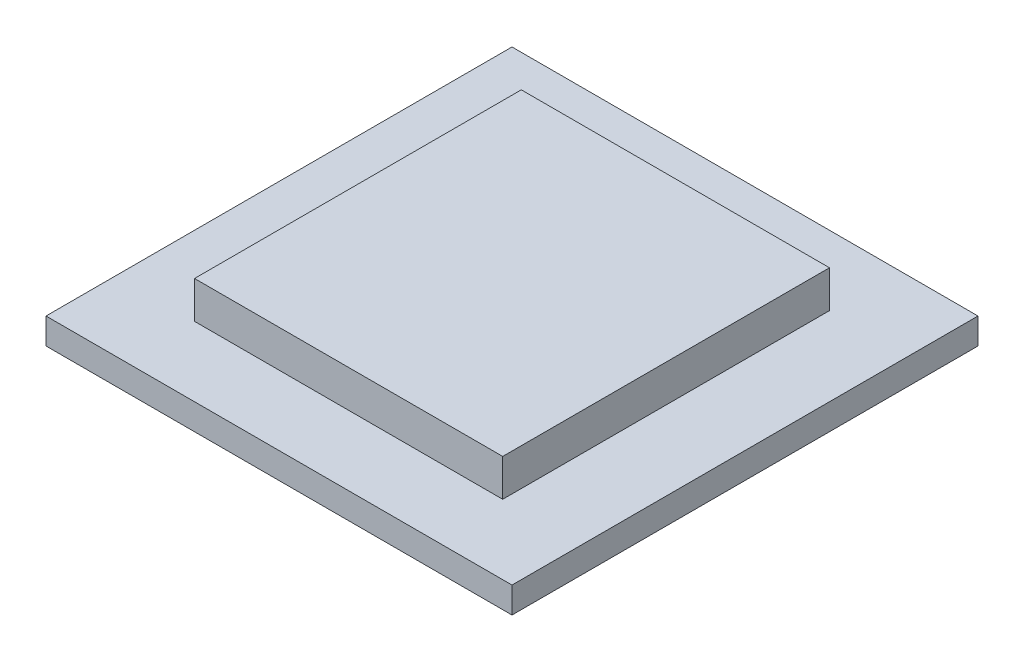
ISO-10303-21;
HEADER;
FILE_DESCRIPTION(('STEP AP214'),'2;1');
FILE_NAME('part.step','',(''),(''),'','','');
FILE_SCHEMA(('AUTOMOTIVE_DESIGN { 1 0 10303 214 1 1 1 1 }'));
ENDSEC;
DATA;
#1=APPLICATION_CONTEXT('core data for automotive mechanical design processes');
#2=APPLICATION_PROTOCOL_DEFINITION('international standard','automotive_design',2000,#1);
#3=PRODUCT_CONTEXT('',#1,'mechanical');
#4=PRODUCT('Part','Part','',(#3));
#5=PRODUCT_RELATED_PRODUCT_CATEGORY('part','',(#4));
#6=PRODUCT_DEFINITION_FORMATION('','',#4);
#7=PRODUCT_DEFINITION_CONTEXT('part definition',#1,'design');
#8=PRODUCT_DEFINITION('design','',#6,#7);
#9=PRODUCT_DEFINITION_SHAPE('','',#8);
#10=(LENGTH_UNIT() NAMED_UNIT(*) SI_UNIT(.MILLI.,.METRE.));
#11=(NAMED_UNIT(*) PLANE_ANGLE_UNIT() SI_UNIT($,.RADIAN.));
#12=(NAMED_UNIT(*) SI_UNIT($,.STERADIAN.) SOLID_ANGLE_UNIT());
#13=UNCERTAINTY_MEASURE_WITH_UNIT(LENGTH_MEASURE(1.E-05),#10,'distance_accuracy_value','');
#14=(GEOMETRIC_REPRESENTATION_CONTEXT(3) GLOBAL_UNCERTAINTY_ASSIGNED_CONTEXT((#13)) GLOBAL_UNIT_ASSIGNED_CONTEXT((#10,
#11,#12)) REPRESENTATION_CONTEXT('',''));
#15=CARTESIAN_POINT('',(0.,0.,0.));
#16=DIRECTION('',(0.,0.,1.));
#17=DIRECTION('',(1.,0.,0.));
#18=AXIS2_PLACEMENT_3D('',#15,#16,#17);
#19=CARTESIAN_POINT('',(-8.3,2.,8.8));
#20=DIRECTION('',(0.,0.,-1.));
#21=DIRECTION('',(-1.,0.,0.));
#22=AXIS2_PLACEMENT_3D('',#19,#20,#21);
#23=PLANE('',#22);
#24=DIRECTION('',(1.,0.,0.));
#25=VECTOR('',#24,1.);
#26=CARTESIAN_POINT('',(-8.3,0.,8.8));
#27=LINE('',#26,#25);
#28=CARTESIAN_POINT('',(-8.3,0.,8.8));
#29=VERTEX_POINT('',#28);
#30=CARTESIAN_POINT('',(8.3,0.,8.8));
#31=VERTEX_POINT('',#30);
#32=EDGE_CURVE('E129',#29,#31,#27,.T.);
#33=ORIENTED_EDGE('',*,*,#32,.T.);
#34=DIRECTION('',(0.,-1.,0.));
#35=VECTOR('',#34,1.);
#36=CARTESIAN_POINT('',(8.3,2.,8.8));
#37=LINE('',#36,#35);
#38=CARTESIAN_POINT('',(8.3,2.,8.8));
#39=VERTEX_POINT('',#38);
#40=EDGE_CURVE('E11',#39,#31,#37,.T.);
#41=ORIENTED_EDGE('',*,*,#40,.F.);
#42=DIRECTION('',(1.,0.,0.));
#43=VECTOR('',#42,1.);
#44=CARTESIAN_POINT('',(-8.3,2.,8.8));
#45=LINE('',#44,#43);
#46=CARTESIAN_POINT('',(-8.3,2.,8.8));
#47=VERTEX_POINT('',#46);
#48=EDGE_CURVE('E140',#47,#39,#45,.T.);
#49=ORIENTED_EDGE('',*,*,#48,.F.);
#50=DIRECTION('',(0.,-1.,0.));
#51=VECTOR('',#50,1.);
#52=CARTESIAN_POINT('',(-8.3,2.,8.8));
#53=LINE('',#52,#51);
#54=EDGE_CURVE('E55',#47,#29,#53,.T.);
#55=ORIENTED_EDGE('',*,*,#54,.T.);
#56=EDGE_LOOP('',(#33,#41,#49,#55));
#57=FACE_BOUND('',#56,.T.);
#58=ADVANCED_FACE('F39',(#57),#23,.F.);
#59=CARTESIAN_POINT('',(8.3,2.,8.8));
#60=DIRECTION('',(-1.,0.,0.));
#61=DIRECTION('',(0.,0.,1.));
#62=AXIS2_PLACEMENT_3D('',#59,#60,#61);
#63=PLANE('',#62);
#64=DIRECTION('',(0.,0.,-1.));
#65=VECTOR('',#64,1.);
#66=CARTESIAN_POINT('',(8.3,0.,8.8));
#67=LINE('',#66,#65);
#68=CARTESIAN_POINT('',(8.3,0.,-8.8));
#69=VERTEX_POINT('',#68);
#70=EDGE_CURVE('E134',#31,#69,#67,.T.);
#71=ORIENTED_EDGE('',*,*,#70,.T.);
#72=DIRECTION('',(0.,-1.,0.));
#73=VECTOR('',#72,1.);
#74=CARTESIAN_POINT('',(8.3,2.,-8.8));
#75=LINE('',#74,#73);
#76=CARTESIAN_POINT('',(8.3,2.,-8.8));
#77=VERTEX_POINT('',#76);
#78=EDGE_CURVE('E48',#77,#69,#75,.T.);
#79=ORIENTED_EDGE('',*,*,#78,.F.);
#80=DIRECTION('',(0.,0.,-1.));
#81=VECTOR('',#80,1.);
#82=CARTESIAN_POINT('',(8.3,2.,8.8));
#83=LINE('',#82,#81);
#84=EDGE_CURVE('E144',#39,#77,#83,.T.);
#85=ORIENTED_EDGE('',*,*,#84,.F.);
#86=ORIENTED_EDGE('',*,*,#40,.T.);
#87=EDGE_LOOP('',(#71,#79,#85,#86));
#88=FACE_BOUND('',#87,.T.);
#89=ADVANCED_FACE('F177',(#88),#63,.F.);
#90=CARTESIAN_POINT('',(-8.3,2.,-8.8));
#91=DIRECTION('',(0.,0.,-1.));
#92=DIRECTION('',(-1.,0.,0.));
#93=AXIS2_PLACEMENT_3D('',#90,#91,#92);
#94=PLANE('',#93);
#95=DIRECTION('',(1.,0.,0.));
#96=VECTOR('',#95,1.);
#97=CARTESIAN_POINT('',(-8.3,0.,-8.8));
#98=LINE('',#97,#96);
#99=CARTESIAN_POINT('',(-8.3,0.,-8.8));
#100=VERTEX_POINT('',#99);
#101=EDGE_CURVE('E158',#100,#69,#98,.T.);
#102=ORIENTED_EDGE('',*,*,#101,.F.);
#103=DIRECTION('',(0.,-1.,0.));
#104=VECTOR('',#103,1.);
#105=CARTESIAN_POINT('',(-8.3,2.,-8.8));
#106=LINE('',#105,#104);
#107=CARTESIAN_POINT('',(-8.3,2.,-8.8));
#108=VERTEX_POINT('',#107);
#109=EDGE_CURVE('E166',#108,#100,#106,.T.);
#110=ORIENTED_EDGE('',*,*,#109,.F.);
#111=DIRECTION('',(1.,0.,0.));
#112=VECTOR('',#111,1.);
#113=CARTESIAN_POINT('',(-8.3,2.,-8.8));
#114=LINE('',#113,#112);
#115=EDGE_CURVE('E148',#108,#77,#114,.T.);
#116=ORIENTED_EDGE('',*,*,#115,.T.);
#117=ORIENTED_EDGE('',*,*,#78,.T.);
#118=EDGE_LOOP('',(#102,#110,#116,#117));
#119=FACE_BOUND('',#118,.T.);
#120=ADVANCED_FACE('F174',(#119),#94,.T.);
#121=CARTESIAN_POINT('',(-8.3,2.,8.8));
#122=DIRECTION('',(-1.,0.,0.));
#123=DIRECTION('',(0.,0.,1.));
#124=AXIS2_PLACEMENT_3D('',#121,#122,#123);
#125=PLANE('',#124);
#126=DIRECTION('',(0.,0.,-1.));
#127=VECTOR('',#126,1.);
#128=CARTESIAN_POINT('',(-8.3,0.,8.8));
#129=LINE('',#128,#127);
#130=EDGE_CURVE('E145',#29,#100,#129,.T.);
#131=ORIENTED_EDGE('',*,*,#130,.F.);
#132=ORIENTED_EDGE('',*,*,#54,.F.);
#133=DIRECTION('',(0.,0.,-1.));
#134=VECTOR('',#133,1.);
#135=CARTESIAN_POINT('',(-8.3,2.,8.8));
#136=LINE('',#135,#134);
#137=EDGE_CURVE('E152',#47,#108,#136,.T.);
#138=ORIENTED_EDGE('',*,*,#137,.T.);
#139=ORIENTED_EDGE('',*,*,#109,.T.);
#140=EDGE_LOOP('',(#131,#132,#138,#139));
#141=FACE_BOUND('',#140,.T.);
#142=ADVANCED_FACE('F182',(#141),#125,.T.);
#143=CARTESIAN_POINT('',(0.,2.,0.));
#144=DIRECTION('',(0.,1.,0.));
#145=DIRECTION('',(0.,0.,1.));
#146=AXIS2_PLACEMENT_3D('',#143,#144,#145);
#147=PLANE('',#146);
#148=ORIENTED_EDGE('',*,*,#48,.T.);
#149=ORIENTED_EDGE('',*,*,#84,.T.);
#150=ORIENTED_EDGE('',*,*,#115,.F.);
#151=ORIENTED_EDGE('',*,*,#137,.F.);
#152=EDGE_LOOP('',(#148,#149,#150,#151));
#153=FACE_BOUND('',#152,.T.);
#154=ADVANCED_FACE('F185',(#153),#147,.T.);
#155=CARTESIAN_POINT('',(-12.55,-1.4,12.55));
#156=DIRECTION('',(1.,0.,0.));
#157=DIRECTION('',(0.,0.,-1.));
#158=AXIS2_PLACEMENT_3D('',#155,#156,#157);
#159=PLANE('',#158);
#160=DIRECTION('',(0.,0.,-1.));
#161=VECTOR('',#160,1.);
#162=CARTESIAN_POINT('',(-12.55,0.,12.55));
#163=LINE('',#162,#161);
#164=CARTESIAN_POINT('',(-12.55,0.,12.55));
#165=VERTEX_POINT('',#164);
#166=CARTESIAN_POINT('',(-12.55,0.,-12.55));
#167=VERTEX_POINT('',#166);
#168=EDGE_CURVE('E127',#165,#167,#163,.T.);
#169=ORIENTED_EDGE('',*,*,#168,.T.);
#170=DIRECTION('',(0.,1.,0.));
#171=VECTOR('',#170,1.);
#172=CARTESIAN_POINT('',(-12.55,-1.4,-12.55));
#173=LINE('',#172,#171);
#174=CARTESIAN_POINT('',(-12.55,-1.4,-12.55));
#175=VERTEX_POINT('',#174);
#176=EDGE_CURVE('E106',#175,#167,#173,.T.);
#177=ORIENTED_EDGE('',*,*,#176,.F.);
#178=DIRECTION('',(0.,0.,-1.));
#179=VECTOR('',#178,1.);
#180=CARTESIAN_POINT('',(-12.55,-1.4,12.55));
#181=LINE('',#180,#179);
#182=CARTESIAN_POINT('',(-12.55,-1.4,12.55));
#183=VERTEX_POINT('',#182);
#184=EDGE_CURVE('E114',#183,#175,#181,.T.);
#185=ORIENTED_EDGE('',*,*,#184,.F.);
#186=DIRECTION('',(0.,1.,0.));
#187=VECTOR('',#186,1.);
#188=CARTESIAN_POINT('',(-12.55,-1.4,12.55));
#189=LINE('',#188,#187);
#190=EDGE_CURVE('E279',#183,#165,#189,.T.);
#191=ORIENTED_EDGE('',*,*,#190,.T.);
#192=EDGE_LOOP('',(#169,#177,#185,#191));
#193=FACE_BOUND('',#192,.T.);
#194=ADVANCED_FACE('F125',(#193),#159,.F.);
#195=CARTESIAN_POINT('',(-12.55,-1.4,-12.55));
#196=DIRECTION('',(0.,0.,1.));
#197=DIRECTION('',(1.,0.,0.));
#198=AXIS2_PLACEMENT_3D('',#195,#196,#197);
#199=PLANE('',#198);
#200=DIRECTION('',(1.,0.,0.));
#201=VECTOR('',#200,1.);
#202=CARTESIAN_POINT('',(-12.55,0.,-12.55));
#203=LINE('',#202,#201);
#204=CARTESIAN_POINT('',(12.55,0.,-12.55));
#205=VERTEX_POINT('',#204);
#206=EDGE_CURVE('E286',#167,#205,#203,.T.);
#207=ORIENTED_EDGE('',*,*,#206,.T.);
#208=DIRECTION('',(0.,1.,0.));
#209=VECTOR('',#208,1.);
#210=CARTESIAN_POINT('',(12.55,-1.4,-12.55));
#211=LINE('',#210,#209);
#212=CARTESIAN_POINT('',(12.55,-1.4,-12.55));
#213=VERTEX_POINT('',#212);
#214=EDGE_CURVE('E108',#213,#205,#211,.T.);
#215=ORIENTED_EDGE('',*,*,#214,.F.);
#216=DIRECTION('',(1.,0.,0.));
#217=VECTOR('',#216,1.);
#218=CARTESIAN_POINT('',(-12.55,-1.4,-12.55));
#219=LINE('',#218,#217);
#220=EDGE_CURVE('E101',#175,#213,#219,.T.);
#221=ORIENTED_EDGE('',*,*,#220,.F.);
#222=ORIENTED_EDGE('',*,*,#176,.T.);
#223=EDGE_LOOP('',(#207,#215,#221,#222));
#224=FACE_BOUND('',#223,.T.);
#225=ADVANCED_FACE('F104',(#224),#199,.F.);
#226=CARTESIAN_POINT('',(12.55,-1.4,12.55));
#227=DIRECTION('',(1.,0.,0.));
#228=DIRECTION('',(0.,0.,-1.));
#229=AXIS2_PLACEMENT_3D('',#226,#227,#228);
#230=PLANE('',#229);
#231=DIRECTION('',(0.,0.,-1.));
#232=VECTOR('',#231,1.);
#233=CARTESIAN_POINT('',(12.55,0.,12.55));
#234=LINE('',#233,#232);
#235=CARTESIAN_POINT('',(12.55,0.,12.55));
#236=VERTEX_POINT('',#235);
#237=EDGE_CURVE('E283',#236,#205,#234,.T.);
#238=ORIENTED_EDGE('',*,*,#237,.F.);
#239=DIRECTION('',(0.,1.,0.));
#240=VECTOR('',#239,1.);
#241=CARTESIAN_POINT('',(12.55,-1.4,12.55));
#242=LINE('',#241,#240);
#243=CARTESIAN_POINT('',(12.55,-1.4,12.55));
#244=VERTEX_POINT('',#243);
#245=EDGE_CURVE('E136',#244,#236,#242,.T.);
#246=ORIENTED_EDGE('',*,*,#245,.F.);
#247=DIRECTION('',(0.,0.,-1.));
#248=VECTOR('',#247,1.);
#249=CARTESIAN_POINT('',(12.55,-1.4,12.55));
#250=LINE('',#249,#248);
#251=EDGE_CURVE('E113',#244,#213,#250,.T.);
#252=ORIENTED_EDGE('',*,*,#251,.T.);
#253=ORIENTED_EDGE('',*,*,#214,.T.);
#254=EDGE_LOOP('',(#238,#246,#252,#253));
#255=FACE_BOUND('',#254,.T.);
#256=ADVANCED_FACE('F204',(#255),#230,.T.);
#257=CARTESIAN_POINT('',(-12.55,-1.4,12.55));
#258=DIRECTION('',(0.,0.,1.));
#259=DIRECTION('',(1.,0.,0.));
#260=AXIS2_PLACEMENT_3D('',#257,#258,#259);
#261=PLANE('',#260);
#262=DIRECTION('',(1.,0.,0.));
#263=VECTOR('',#262,1.);
#264=CARTESIAN_POINT('',(-12.55,0.,12.55));
#265=LINE('',#264,#263);
#266=EDGE_CURVE('E123',#165,#236,#265,.T.);
#267=ORIENTED_EDGE('',*,*,#266,.F.);
#268=ORIENTED_EDGE('',*,*,#190,.F.);
#269=DIRECTION('',(1.,0.,0.));
#270=VECTOR('',#269,1.);
#271=CARTESIAN_POINT('',(-12.55,-1.4,12.55));
#272=LINE('',#271,#270);
#273=EDGE_CURVE('E120',#183,#244,#272,.T.);
#274=ORIENTED_EDGE('',*,*,#273,.T.);
#275=ORIENTED_EDGE('',*,*,#245,.T.);
#276=EDGE_LOOP('',(#267,#268,#274,#275));
#277=FACE_BOUND('',#276,.T.);
#278=ADVANCED_FACE('F207',(#277),#261,.T.);
#279=CARTESIAN_POINT('',(0.,-1.4,0.));
#280=DIRECTION('',(0.,-1.,0.));
#281=DIRECTION('',(0.,0.,-1.));
#282=AXIS2_PLACEMENT_3D('',#279,#280,#281);
#283=PLANE('',#282);
#284=ORIENTED_EDGE('',*,*,#184,.T.);
#285=ORIENTED_EDGE('',*,*,#220,.T.);
#286=ORIENTED_EDGE('',*,*,#251,.F.);
#287=ORIENTED_EDGE('',*,*,#273,.F.);
#288=EDGE_LOOP('',(#284,#285,#286,#287));
#289=FACE_BOUND('',#288,.T.);
#290=ADVANCED_FACE('F118',(#289),#283,.T.);
#291=CARTESIAN_POINT('',(0.,0.,0.));
#292=DIRECTION('',(0.,-1.,0.));
#293=DIRECTION('',(0.,0.,-1.));
#294=AXIS2_PLACEMENT_3D('',#291,#292,#293);
#295=PLANE('',#294);
#296=ORIENTED_EDGE('',*,*,#32,.F.);
#297=ORIENTED_EDGE('',*,*,#130,.T.);
#298=ORIENTED_EDGE('',*,*,#101,.T.);
#299=ORIENTED_EDGE('',*,*,#70,.F.);
#300=EDGE_LOOP('',(#296,#297,#298,#299));
#301=FACE_BOUND('',#300,.T.);
#302=ORIENTED_EDGE('',*,*,#168,.F.);
#303=ORIENTED_EDGE('',*,*,#266,.T.);
#304=ORIENTED_EDGE('',*,*,#237,.T.);
#305=ORIENTED_EDGE('',*,*,#206,.F.);
#306=EDGE_LOOP('',(#302,#303,#304,#305));
#307=FACE_BOUND('',#306,.T.);
#308=ADVANCED_FACE('F180',(#301,#307),#295,.F.);
#309=CLOSED_SHELL('',(#58,#89,#120,#142,#154,#194,#225,#256,#278,#290,#308));
#310=MANIFOLD_SOLID_BREP('B2',#309);
#311=ADVANCED_BREP_SHAPE_REPRESENTATION('',(#18,#310),#14);
#312=SHAPE_DEFINITION_REPRESENTATION(#9,#311);
ENDSEC;
END-ISO-10303-21;
